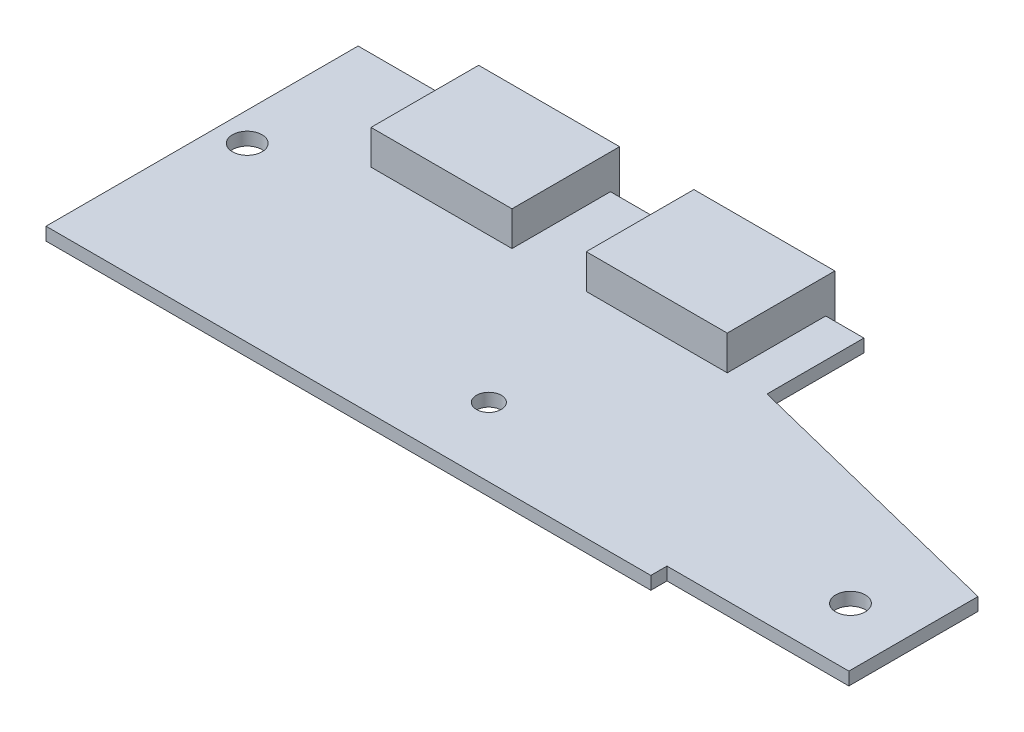
ISO-10303-21;
HEADER;
FILE_DESCRIPTION(('STEP AP214'),'2;1');
FILE_NAME('part.step','',(''),(''),'','','');
FILE_SCHEMA(('AUTOMOTIVE_DESIGN { 1 0 10303 214 1 1 1 1 }'));
ENDSEC;
DATA;
#1=APPLICATION_CONTEXT('core data for automotive mechanical design processes');
#2=APPLICATION_PROTOCOL_DEFINITION('international standard','automotive_design',2000,#1);
#3=PRODUCT_CONTEXT('',#1,'mechanical');
#4=PRODUCT('Part','Part','',(#3));
#5=PRODUCT_RELATED_PRODUCT_CATEGORY('part','',(#4));
#6=PRODUCT_DEFINITION_FORMATION('','',#4);
#7=PRODUCT_DEFINITION_CONTEXT('part definition',#1,'design');
#8=PRODUCT_DEFINITION('design','',#6,#7);
#9=PRODUCT_DEFINITION_SHAPE('','',#8);
#10=(LENGTH_UNIT() NAMED_UNIT(*) SI_UNIT(.MILLI.,.METRE.));
#11=(NAMED_UNIT(*) PLANE_ANGLE_UNIT() SI_UNIT($,.RADIAN.));
#12=(NAMED_UNIT(*) SI_UNIT($,.STERADIAN.) SOLID_ANGLE_UNIT());
#13=UNCERTAINTY_MEASURE_WITH_UNIT(LENGTH_MEASURE(1.E-05),#10,'distance_accuracy_value','');
#14=(GEOMETRIC_REPRESENTATION_CONTEXT(3) GLOBAL_UNCERTAINTY_ASSIGNED_CONTEXT((#13)) GLOBAL_UNIT_ASSIGNED_CONTEXT((#10,
#11,#12)) REPRESENTATION_CONTEXT('',''));
#15=CARTESIAN_POINT('',(0.,0.,0.));
#16=DIRECTION('',(0.,0.,1.));
#17=DIRECTION('',(1.,0.,0.));
#18=AXIS2_PLACEMENT_3D('',#15,#16,#17);
#19=CARTESIAN_POINT('',(0.,0.,0.));
#20=DIRECTION('',(0.,-1.,0.));
#21=DIRECTION('',(0.,0.,-1.));
#22=AXIS2_PLACEMENT_3D('',#19,#20,#21);
#23=PLANE('',#22);
#24=DIRECTION('',(0.,0.,-1.));
#25=VECTOR('',#24,1.);
#26=CARTESIAN_POINT('',(30.35,0.,0.));
#27=LINE('',#26,#25);
#28=CARTESIAN_POINT('',(30.35,0.,-19.85));
#29=VERTEX_POINT('',#28);
#30=CARTESIAN_POINT('',(30.35,0.,-29.));
#31=VERTEX_POINT('',#30);
#32=EDGE_CURVE('E11',#29,#31,#27,.T.);
#33=ORIENTED_EDGE('',*,*,#32,.F.);
#34=DIRECTION('',(-1.,0.,0.));
#35=VECTOR('',#34,1.);
#36=CARTESIAN_POINT('',(0.,0.,-19.85));
#37=LINE('',#36,#35);
#38=CARTESIAN_POINT('',(43.45,0.,-19.85));
#39=VERTEX_POINT('',#38);
#40=EDGE_CURVE('E432',#39,#29,#37,.T.);
#41=ORIENTED_EDGE('',*,*,#40,.F.);
#42=DIRECTION('',(0.,0.,1.));
#43=VECTOR('',#42,1.);
#44=CARTESIAN_POINT('',(43.45,0.,0.));
#45=LINE('',#44,#43);
#46=CARTESIAN_POINT('',(43.45,0.,-29.));
#47=VERTEX_POINT('',#46);
#48=EDGE_CURVE('E43',#47,#39,#45,.T.);
#49=ORIENTED_EDGE('',*,*,#48,.F.);
#50=DIRECTION('',(-1.,0.,0.));
#51=VECTOR('',#50,1.);
#52=CARTESIAN_POINT('',(0.,0.,-29.));
#53=LINE('',#52,#51);
#54=CARTESIAN_POINT('',(47.,0.,-29.));
#55=VERTEX_POINT('',#54);
#56=EDGE_CURVE('E395',#55,#47,#53,.T.);
#57=ORIENTED_EDGE('',*,*,#56,.F.);
#58=DIRECTION('',(0.,0.,-1.));
#59=VECTOR('',#58,1.);
#60=CARTESIAN_POINT('',(47.,0.,-29.));
#61=LINE('',#60,#59);
#62=CARTESIAN_POINT('',(47.,0.,-20.));
#63=VERTEX_POINT('',#62);
#64=EDGE_CURVE('E392',#63,#55,#61,.T.);
#65=ORIENTED_EDGE('',*,*,#64,.F.);
#66=DIRECTION('',(-0.970360803239584,0.,-0.241660736438977));
#67=VECTOR('',#66,1.);
#68=CARTESIAN_POINT('',(47.,0.,-20.));
#69=LINE('',#68,#67);
#70=CARTESIAN_POINT('',(73.1,0.,-13.5));
#71=VERTEX_POINT('',#70);
#72=EDGE_CURVE('E390',#71,#63,#69,.T.);
#73=ORIENTED_EDGE('',*,*,#72,.F.);
#74=DIRECTION('',(0.,0.,-1.));
#75=VECTOR('',#74,1.);
#76=CARTESIAN_POINT('',(73.1,0.,-13.5));
#77=LINE('',#76,#75);
#78=CARTESIAN_POINT('',(73.1,0.,-1.50000000000001));
#79=VERTEX_POINT('',#78);
#80=EDGE_CURVE('E388',#79,#71,#77,.T.);
#81=ORIENTED_EDGE('',*,*,#80,.F.);
#82=DIRECTION('',(1.,0.,0.));
#83=VECTOR('',#82,1.);
#84=CARTESIAN_POINT('',(73.1,0.,-1.50000000000001));
#85=LINE('',#84,#83);
#86=CARTESIAN_POINT('',(56.2,0.,-1.50000000000001));
#87=VERTEX_POINT('',#86);
#88=EDGE_CURVE('E386',#87,#79,#85,.T.);
#89=ORIENTED_EDGE('',*,*,#88,.F.);
#90=DIRECTION('',(0.,0.,-1.));
#91=VECTOR('',#90,1.);
#92=CARTESIAN_POINT('',(56.2,0.,-1.50000000000001));
#93=LINE('',#92,#91);
#94=CARTESIAN_POINT('',(56.2,0.,0.));
#95=VERTEX_POINT('',#94);
#96=EDGE_CURVE('E384',#95,#87,#93,.T.);
#97=ORIENTED_EDGE('',*,*,#96,.F.);
#98=DIRECTION('',(1.,0.,0.));
#99=VECTOR('',#98,1.);
#100=CARTESIAN_POINT('',(56.2,0.,0.));
#101=LINE('',#100,#99);
#102=CARTESIAN_POINT('',(0.,0.,0.));
#103=VERTEX_POINT('',#102);
#104=EDGE_CURVE('E345',#103,#95,#101,.T.);
#105=ORIENTED_EDGE('',*,*,#104,.F.);
#106=DIRECTION('',(0.,0.,1.));
#107=VECTOR('',#106,1.);
#108=CARTESIAN_POINT('',(0.,0.,0.));
#109=LINE('',#108,#107);
#110=CARTESIAN_POINT('',(0.,0.,-29.));
#111=VERTEX_POINT('',#110);
#112=EDGE_CURVE('E364',#111,#103,#109,.T.);
#113=ORIENTED_EDGE('',*,*,#112,.F.);
#114=CARTESIAN_POINT('',(10.35,0.,-29.));
#115=VERTEX_POINT('',#114);
#116=EDGE_CURVE('E394',#115,#111,#53,.T.);
#117=ORIENTED_EDGE('',*,*,#116,.F.);
#118=DIRECTION('',(0.,0.,-1.));
#119=VECTOR('',#118,1.);
#120=CARTESIAN_POINT('',(10.35,0.,0.));
#121=LINE('',#120,#119);
#122=CARTESIAN_POINT('',(10.35,0.,-19.85));
#123=VERTEX_POINT('',#122);
#124=EDGE_CURVE('E429',#123,#115,#121,.T.);
#125=ORIENTED_EDGE('',*,*,#124,.F.);
#126=DIRECTION('',(-1.,0.,0.));
#127=VECTOR('',#126,1.);
#128=CARTESIAN_POINT('',(0.,0.,-19.85));
#129=LINE('',#128,#127);
#130=CARTESIAN_POINT('',(23.45,0.,-19.85));
#131=VERTEX_POINT('',#130);
#132=EDGE_CURVE('E423',#131,#123,#129,.T.);
#133=ORIENTED_EDGE('',*,*,#132,.F.);
#134=DIRECTION('',(0.,0.,1.));
#135=VECTOR('',#134,1.);
#136=CARTESIAN_POINT('',(23.45,0.,0.));
#137=LINE('',#136,#135);
#138=CARTESIAN_POINT('',(23.45,0.,-29.));
#139=VERTEX_POINT('',#138);
#140=EDGE_CURVE('E426',#139,#131,#137,.T.);
#141=ORIENTED_EDGE('',*,*,#140,.F.);
#142=EDGE_CURVE('E398',#31,#139,#53,.T.);
#143=ORIENTED_EDGE('',*,*,#142,.F.);
#144=EDGE_LOOP('',(#33,#41,#49,#57,#65,#73,#81,#89,#97,#105,#113,#117,#125,#133,#141,#143));
#145=FACE_BOUND('',#144,.T.);
#146=CARTESIAN_POINT('',(2.675,0.,-16.025));
#147=DIRECTION('',(0.,1.,0.));
#148=DIRECTION('',(0.,0.,1.));
#149=AXIS2_PLACEMENT_3D('',#146,#147,#148);
#150=CIRCLE('',#149,1.375);
#151=CARTESIAN_POINT('',(2.675,0.,-14.65));
#152=VERTEX_POINT('',#151);
#153=EDGE_CURVE('E342',#152,#152,#150,.T.);
#154=ORIENTED_EDGE('',*,*,#153,.T.);
#155=EDGE_LOOP('',(#154));
#156=FACE_BOUND('',#155,.T.);
#157=CARTESIAN_POINT('',(67.725,0.,-7.02500000000001));
#158=DIRECTION('',(0.,1.,0.));
#159=DIRECTION('',(0.,0.,1.));
#160=AXIS2_PLACEMENT_3D('',#157,#158,#159);
#161=CIRCLE('',#160,1.375);
#162=CARTESIAN_POINT('',(67.725,0.,-5.65));
#163=VERTEX_POINT('',#162);
#164=EDGE_CURVE('E349',#163,#163,#161,.T.);
#165=ORIENTED_EDGE('',*,*,#164,.T.);
#166=EDGE_LOOP('',(#165));
#167=FACE_BOUND('',#166,.T.);
#168=CARTESIAN_POINT('',(34.75,0.,-6.4));
#169=DIRECTION('',(0.,1.,0.));
#170=DIRECTION('',(0.,0.,1.));
#171=AXIS2_PLACEMENT_3D('',#168,#169,#170);
#172=CIRCLE('',#171,1.15);
#173=CARTESIAN_POINT('',(34.75,0.,-5.25));
#174=VERTEX_POINT('',#173);
#175=EDGE_CURVE('E355',#174,#174,#172,.T.);
#176=ORIENTED_EDGE('',*,*,#175,.T.);
#177=EDGE_LOOP('',(#176));
#178=FACE_BOUND('',#177,.T.);
#179=DIRECTION('',(1.,0.,0.));
#180=VECTOR('',#179,1.);
#181=CARTESIAN_POINT('',(15.5,0.,-10.8));
#182=LINE('',#181,#180);
#183=CARTESIAN_POINT('',(15.5,0.,-10.8));
#184=VERTEX_POINT('',#183);
#185=CARTESIAN_POINT('',(20.8,0.,-10.8));
#186=VERTEX_POINT('',#185);
#187=EDGE_CURVE('E821',#184,#186,#182,.T.);
#188=ORIENTED_EDGE('',*,*,#187,.F.);
#189=DIRECTION('',(0.,0.,-1.));
#190=VECTOR('',#189,1.);
#191=CARTESIAN_POINT('',(15.5,0.,-5.5));
#192=LINE('',#191,#190);
#193=CARTESIAN_POINT('',(15.5,0.,-5.5));
#194=VERTEX_POINT('',#193);
#195=EDGE_CURVE('E243',#194,#184,#192,.T.);
#196=ORIENTED_EDGE('',*,*,#195,.F.);
#197=DIRECTION('',(-1.,0.,0.));
#198=VECTOR('',#197,1.);
#199=CARTESIAN_POINT('',(15.5,0.,-5.5));
#200=LINE('',#199,#198);
#201=CARTESIAN_POINT('',(20.8,0.,-5.5));
#202=VERTEX_POINT('',#201);
#203=EDGE_CURVE('E239',#202,#194,#200,.T.);
#204=ORIENTED_EDGE('',*,*,#203,.F.);
#205=DIRECTION('',(0.,0.,1.));
#206=VECTOR('',#205,1.);
#207=CARTESIAN_POINT('',(20.8,0.,-5.5));
#208=LINE('',#207,#206);
#209=EDGE_CURVE('E818',#186,#202,#208,.T.);
#210=ORIENTED_EDGE('',*,*,#209,.F.);
#211=EDGE_LOOP('',(#188,#196,#204,#210));
#212=FACE_BOUND('',#211,.T.);
#213=ADVANCED_FACE('F35',(#145,#156,#167,#178,#212),#23,.T.);
#214=CARTESIAN_POINT('',(0.,1.2,-29.));
#215=DIRECTION('',(0.,0.,1.));
#216=DIRECTION('',(1.,0.,0.));
#217=AXIS2_PLACEMENT_3D('',#214,#215,#216);
#218=PLANE('',#217);
#219=DIRECTION('',(-1.,0.,0.));
#220=VECTOR('',#219,1.);
#221=CARTESIAN_POINT('',(0.,1.2,-29.));
#222=LINE('',#221,#220);
#223=CARTESIAN_POINT('',(30.35,1.2,-29.));
#224=VERTEX_POINT('',#223);
#225=CARTESIAN_POINT('',(23.45,1.2,-29.));
#226=VERTEX_POINT('',#225);
#227=EDGE_CURVE('E379',#224,#226,#222,.T.);
#228=ORIENTED_EDGE('',*,*,#227,.F.);
#229=DIRECTION('',(0.,-1.,0.));
#230=VECTOR('',#229,1.);
#231=CARTESIAN_POINT('',(30.35,1.2,-29.));
#232=LINE('',#231,#230);
#233=EDGE_CURVE('E290',#224,#31,#232,.T.);
#234=ORIENTED_EDGE('',*,*,#233,.T.);
#235=ORIENTED_EDGE('',*,*,#142,.T.);
#236=DIRECTION('',(0.,1.,0.));
#237=VECTOR('',#236,1.);
#238=CARTESIAN_POINT('',(23.45,1.2,-29.));
#239=LINE('',#238,#237);
#240=EDGE_CURVE('E332',#139,#226,#239,.T.);
#241=ORIENTED_EDGE('',*,*,#240,.T.);
#242=EDGE_LOOP('',(#228,#234,#235,#241));
#243=FACE_BOUND('',#242,.T.);
#244=ADVANCED_FACE('F467',(#243),#218,.F.);
#245=CARTESIAN_POINT('',(10.35,1.2,-29.));
#246=VERTEX_POINT('',#245);
#247=CARTESIAN_POINT('',(0.,1.2,-29.));
#248=VERTEX_POINT('',#247);
#249=EDGE_CURVE('E374',#246,#248,#222,.T.);
#250=ORIENTED_EDGE('',*,*,#249,.F.);
#251=DIRECTION('',(0.,-1.,0.));
#252=VECTOR('',#251,1.);
#253=CARTESIAN_POINT('',(10.35,1.2,-29.));
#254=LINE('',#253,#252);
#255=EDGE_CURVE('E337',#246,#115,#254,.T.);
#256=ORIENTED_EDGE('',*,*,#255,.T.);
#257=ORIENTED_EDGE('',*,*,#116,.T.);
#258=DIRECTION('',(0.,-1.,0.));
#259=VECTOR('',#258,1.);
#260=CARTESIAN_POINT('',(0.,1.2,-29.));
#261=LINE('',#260,#259);
#262=EDGE_CURVE('E402',#248,#111,#261,.T.);
#263=ORIENTED_EDGE('',*,*,#262,.F.);
#264=EDGE_LOOP('',(#250,#256,#257,#263));
#265=FACE_BOUND('',#264,.T.);
#266=ADVANCED_FACE('F478',(#265),#218,.F.);
#267=CARTESIAN_POINT('',(56.2,1.2,0.));
#268=DIRECTION('',(0.,0.,-1.));
#269=DIRECTION('',(-1.,0.,0.));
#270=AXIS2_PLACEMENT_3D('',#267,#268,#269);
#271=PLANE('',#270);
#272=ORIENTED_EDGE('',*,*,#104,.T.);
#273=DIRECTION('',(0.,-1.,0.));
#274=VECTOR('',#273,1.);
#275=CARTESIAN_POINT('',(56.2,1.2,0.));
#276=LINE('',#275,#274);
#277=CARTESIAN_POINT('',(56.2,1.2,0.));
#278=VERTEX_POINT('',#277);
#279=EDGE_CURVE('E420',#278,#95,#276,.T.);
#280=ORIENTED_EDGE('',*,*,#279,.F.);
#281=DIRECTION('',(1.,0.,0.));
#282=VECTOR('',#281,1.);
#283=CARTESIAN_POINT('',(56.2,1.2,0.));
#284=LINE('',#283,#282);
#285=CARTESIAN_POINT('',(0.,1.2,0.));
#286=VERTEX_POINT('',#285);
#287=EDGE_CURVE('E360',#286,#278,#284,.T.);
#288=ORIENTED_EDGE('',*,*,#287,.F.);
#289=DIRECTION('',(0.,-1.,0.));
#290=VECTOR('',#289,1.);
#291=CARTESIAN_POINT('',(0.,1.2,0.));
#292=LINE('',#291,#290);
#293=EDGE_CURVE('E381',#286,#103,#292,.T.);
#294=ORIENTED_EDGE('',*,*,#293,.T.);
#295=EDGE_LOOP('',(#272,#280,#288,#294));
#296=FACE_BOUND('',#295,.T.);
#297=ADVANCED_FACE('F37',(#296),#271,.F.);
#298=CARTESIAN_POINT('',(56.2,1.2,-1.50000000000001));
#299=DIRECTION('',(-1.,0.,0.));
#300=DIRECTION('',(0.,0.,1.));
#301=AXIS2_PLACEMENT_3D('',#298,#299,#300);
#302=PLANE('',#301);
#303=ORIENTED_EDGE('',*,*,#96,.T.);
#304=DIRECTION('',(0.,-1.,0.));
#305=VECTOR('',#304,1.);
#306=CARTESIAN_POINT('',(56.2,1.2,-1.50000000000001));
#307=LINE('',#306,#305);
#308=CARTESIAN_POINT('',(56.2,1.2,-1.50000000000001));
#309=VERTEX_POINT('',#308);
#310=EDGE_CURVE('E417',#309,#87,#307,.T.);
#311=ORIENTED_EDGE('',*,*,#310,.F.);
#312=DIRECTION('',(0.,0.,-1.));
#313=VECTOR('',#312,1.);
#314=CARTESIAN_POINT('',(56.2,1.2,-1.50000000000001));
#315=LINE('',#314,#313);
#316=EDGE_CURVE('E363',#278,#309,#315,.T.);
#317=ORIENTED_EDGE('',*,*,#316,.F.);
#318=ORIENTED_EDGE('',*,*,#279,.T.);
#319=EDGE_LOOP('',(#303,#311,#317,#318));
#320=FACE_BOUND('',#319,.T.);
#321=ADVANCED_FACE('F491',(#320),#302,.F.);
#322=CARTESIAN_POINT('',(73.1,1.2,-1.50000000000001));
#323=DIRECTION('',(0.,0.,-1.));
#324=DIRECTION('',(-1.,0.,0.));
#325=AXIS2_PLACEMENT_3D('',#322,#323,#324);
#326=PLANE('',#325);
#327=ORIENTED_EDGE('',*,*,#88,.T.);
#328=DIRECTION('',(0.,-1.,0.));
#329=VECTOR('',#328,1.);
#330=CARTESIAN_POINT('',(73.1,1.2,-1.50000000000001));
#331=LINE('',#330,#329);
#332=CARTESIAN_POINT('',(73.1,1.2,-1.50000000000001));
#333=VERTEX_POINT('',#332);
#334=EDGE_CURVE('E414',#333,#79,#331,.T.);
#335=ORIENTED_EDGE('',*,*,#334,.F.);
#336=DIRECTION('',(1.,0.,0.));
#337=VECTOR('',#336,1.);
#338=CARTESIAN_POINT('',(73.1,1.2,-1.50000000000001));
#339=LINE('',#338,#337);
#340=EDGE_CURVE('E366',#309,#333,#339,.T.);
#341=ORIENTED_EDGE('',*,*,#340,.F.);
#342=ORIENTED_EDGE('',*,*,#310,.T.);
#343=EDGE_LOOP('',(#327,#335,#341,#342));
#344=FACE_BOUND('',#343,.T.);
#345=ADVANCED_FACE('F494',(#344),#326,.F.);
#346=CARTESIAN_POINT('',(73.1,1.2,-13.5));
#347=DIRECTION('',(-1.,0.,0.));
#348=DIRECTION('',(0.,0.,1.));
#349=AXIS2_PLACEMENT_3D('',#346,#347,#348);
#350=PLANE('',#349);
#351=ORIENTED_EDGE('',*,*,#80,.T.);
#352=DIRECTION('',(0.,-1.,0.));
#353=VECTOR('',#352,1.);
#354=CARTESIAN_POINT('',(73.1,1.2,-13.5));
#355=LINE('',#354,#353);
#356=CARTESIAN_POINT('',(73.1,1.2,-13.5));
#357=VERTEX_POINT('',#356);
#358=EDGE_CURVE('E411',#357,#71,#355,.T.);
#359=ORIENTED_EDGE('',*,*,#358,.F.);
#360=DIRECTION('',(0.,0.,-1.));
#361=VECTOR('',#360,1.);
#362=CARTESIAN_POINT('',(73.1,1.2,-13.5));
#363=LINE('',#362,#361);
#364=EDGE_CURVE('E368',#333,#357,#363,.T.);
#365=ORIENTED_EDGE('',*,*,#364,.F.);
#366=ORIENTED_EDGE('',*,*,#334,.T.);
#367=EDGE_LOOP('',(#351,#359,#365,#366));
#368=FACE_BOUND('',#367,.T.);
#369=ADVANCED_FACE('F499',(#368),#350,.F.);
#370=CARTESIAN_POINT('',(47.,1.2,-20.));
#371=DIRECTION('',(-0.241660736438977,0.,0.970360803239585));
#372=DIRECTION('',(0.970360803239585,0.,0.241660736438977));
#373=AXIS2_PLACEMENT_3D('',#370,#371,#372);
#374=PLANE('',#373);
#375=ORIENTED_EDGE('',*,*,#72,.T.);
#376=DIRECTION('',(0.,-1.,0.));
#377=VECTOR('',#376,1.);
#378=CARTESIAN_POINT('',(47.,1.2,-20.));
#379=LINE('',#378,#377);
#380=CARTESIAN_POINT('',(47.,1.2,-20.));
#381=VERTEX_POINT('',#380);
#382=EDGE_CURVE('E408',#381,#63,#379,.T.);
#383=ORIENTED_EDGE('',*,*,#382,.F.);
#384=DIRECTION('',(-0.970360803239584,0.,-0.241660736438977));
#385=VECTOR('',#384,1.);
#386=CARTESIAN_POINT('',(47.,1.2,-20.));
#387=LINE('',#386,#385);
#388=EDGE_CURVE('E370',#357,#381,#387,.T.);
#389=ORIENTED_EDGE('',*,*,#388,.F.);
#390=ORIENTED_EDGE('',*,*,#358,.T.);
#391=EDGE_LOOP('',(#375,#383,#389,#390));
#392=FACE_BOUND('',#391,.T.);
#393=ADVANCED_FACE('F505',(#392),#374,.F.);
#394=CARTESIAN_POINT('',(47.,1.2,-29.));
#395=DIRECTION('',(-1.,0.,0.));
#396=DIRECTION('',(0.,0.,1.));
#397=AXIS2_PLACEMENT_3D('',#394,#395,#396);
#398=PLANE('',#397);
#399=ORIENTED_EDGE('',*,*,#64,.T.);
#400=DIRECTION('',(0.,-1.,0.));
#401=VECTOR('',#400,1.);
#402=CARTESIAN_POINT('',(47.,1.2,-29.));
#403=LINE('',#402,#401);
#404=CARTESIAN_POINT('',(47.,1.2,-29.));
#405=VERTEX_POINT('',#404);
#406=EDGE_CURVE('E405',#405,#55,#403,.T.);
#407=ORIENTED_EDGE('',*,*,#406,.F.);
#408=DIRECTION('',(0.,0.,-1.));
#409=VECTOR('',#408,1.);
#410=CARTESIAN_POINT('',(47.,1.2,-29.));
#411=LINE('',#410,#409);
#412=EDGE_CURVE('E372',#381,#405,#411,.T.);
#413=ORIENTED_EDGE('',*,*,#412,.F.);
#414=ORIENTED_EDGE('',*,*,#382,.T.);
#415=EDGE_LOOP('',(#399,#407,#413,#414));
#416=FACE_BOUND('',#415,.T.);
#417=ADVANCED_FACE('F509',(#416),#398,.F.);
#418=ORIENTED_EDGE('',*,*,#56,.T.);
#419=DIRECTION('',(0.,1.,0.));
#420=VECTOR('',#419,1.);
#421=CARTESIAN_POINT('',(43.45,1.2,-29.));
#422=LINE('',#421,#420);
#423=CARTESIAN_POINT('',(43.45,1.2,-29.));
#424=VERTEX_POINT('',#423);
#425=EDGE_CURVE('E286',#47,#424,#422,.T.);
#426=ORIENTED_EDGE('',*,*,#425,.T.);
#427=EDGE_CURVE('E375',#405,#424,#222,.T.);
#428=ORIENTED_EDGE('',*,*,#427,.F.);
#429=ORIENTED_EDGE('',*,*,#406,.T.);
#430=EDGE_LOOP('',(#418,#426,#428,#429));
#431=FACE_BOUND('',#430,.T.);
#432=ADVANCED_FACE('F512',(#431),#218,.F.);
#433=CARTESIAN_POINT('',(0.,1.2,0.));
#434=DIRECTION('',(1.,0.,0.));
#435=DIRECTION('',(0.,0.,-1.));
#436=AXIS2_PLACEMENT_3D('',#433,#434,#435);
#437=PLANE('',#436);
#438=ORIENTED_EDGE('',*,*,#112,.T.);
#439=ORIENTED_EDGE('',*,*,#293,.F.);
#440=DIRECTION('',(0.,0.,1.));
#441=VECTOR('',#440,1.);
#442=CARTESIAN_POINT('',(0.,1.2,0.));
#443=LINE('',#442,#441);
#444=EDGE_CURVE('E378',#248,#286,#443,.T.);
#445=ORIENTED_EDGE('',*,*,#444,.F.);
#446=ORIENTED_EDGE('',*,*,#262,.T.);
#447=EDGE_LOOP('',(#438,#439,#445,#446));
#448=FACE_BOUND('',#447,.T.);
#449=ADVANCED_FACE('F482',(#448),#437,.F.);
#450=CARTESIAN_POINT('',(0.,1.2,0.));
#451=DIRECTION('',(0.,-1.,0.));
#452=DIRECTION('',(0.,0.,-1.));
#453=AXIS2_PLACEMENT_3D('',#450,#451,#452);
#454=PLANE('',#453);
#455=CARTESIAN_POINT('',(2.675,1.2,-16.025));
#456=DIRECTION('',(0.,1.,0.));
#457=DIRECTION('',(0.,0.,1.));
#458=AXIS2_PLACEMENT_3D('',#455,#456,#457);
#459=CIRCLE('',#458,1.375);
#460=CARTESIAN_POINT('',(2.675,1.2,-14.65));
#461=VERTEX_POINT('',#460);
#462=EDGE_CURVE('E346',#461,#461,#459,.T.);
#463=ORIENTED_EDGE('',*,*,#462,.F.);
#464=EDGE_LOOP('',(#463));
#465=FACE_BOUND('',#464,.T.);
#466=CARTESIAN_POINT('',(67.725,1.2,-7.02500000000001));
#467=DIRECTION('',(0.,1.,0.));
#468=DIRECTION('',(0.,0.,1.));
#469=AXIS2_PLACEMENT_3D('',#466,#467,#468);
#470=CIRCLE('',#469,1.375);
#471=CARTESIAN_POINT('',(67.725,1.2,-5.65));
#472=VERTEX_POINT('',#471);
#473=EDGE_CURVE('E352',#472,#472,#470,.T.);
#474=ORIENTED_EDGE('',*,*,#473,.F.);
#475=EDGE_LOOP('',(#474));
#476=FACE_BOUND('',#475,.T.);
#477=CARTESIAN_POINT('',(34.75,1.2,-6.4));
#478=DIRECTION('',(0.,1.,0.));
#479=DIRECTION('',(0.,0.,1.));
#480=AXIS2_PLACEMENT_3D('',#477,#478,#479);
#481=CIRCLE('',#480,1.15);
#482=CARTESIAN_POINT('',(34.75,1.2,-5.25));
#483=VERTEX_POINT('',#482);
#484=EDGE_CURVE('E341',#483,#483,#481,.T.);
#485=ORIENTED_EDGE('',*,*,#484,.F.);
#486=EDGE_LOOP('',(#485));
#487=FACE_BOUND('',#486,.T.);
#488=DIRECTION('',(-1.,0.,0.));
#489=VECTOR('',#488,1.);
#490=CARTESIAN_POINT('',(0.,1.2,-19.85));
#491=LINE('',#490,#489);
#492=CARTESIAN_POINT('',(43.45,1.2,-19.85));
#493=VERTEX_POINT('',#492);
#494=CARTESIAN_POINT('',(30.35,1.2,-19.85));
#495=VERTEX_POINT('',#494);
#496=EDGE_CURVE('E58',#493,#495,#491,.T.);
#497=ORIENTED_EDGE('',*,*,#496,.T.);
#498=DIRECTION('',(0.,0.,-1.));
#499=VECTOR('',#498,1.);
#500=CARTESIAN_POINT('',(30.35,1.2,0.));
#501=LINE('',#500,#499);
#502=EDGE_CURVE('E292',#495,#224,#501,.T.);
#503=ORIENTED_EDGE('',*,*,#502,.T.);
#504=ORIENTED_EDGE('',*,*,#227,.T.);
#505=DIRECTION('',(0.,0.,1.));
#506=VECTOR('',#505,1.);
#507=CARTESIAN_POINT('',(23.45,1.2,0.));
#508=LINE('',#507,#506);
#509=CARTESIAN_POINT('',(23.45,1.2,-19.85));
#510=VERTEX_POINT('',#509);
#511=EDGE_CURVE('E335',#226,#510,#508,.T.);
#512=ORIENTED_EDGE('',*,*,#511,.T.);
#513=DIRECTION('',(-1.,0.,0.));
#514=VECTOR('',#513,1.);
#515=CARTESIAN_POINT('',(0.,1.2,-19.85));
#516=LINE('',#515,#514);
#517=CARTESIAN_POINT('',(10.35,1.2,-19.85));
#518=VERTEX_POINT('',#517);
#519=EDGE_CURVE('E321',#510,#518,#516,.T.);
#520=ORIENTED_EDGE('',*,*,#519,.T.);
#521=DIRECTION('',(0.,0.,-1.));
#522=VECTOR('',#521,1.);
#523=CARTESIAN_POINT('',(10.35,1.2,0.));
#524=LINE('',#523,#522);
#525=EDGE_CURVE('E339',#518,#246,#524,.T.);
#526=ORIENTED_EDGE('',*,*,#525,.T.);
#527=ORIENTED_EDGE('',*,*,#249,.T.);
#528=ORIENTED_EDGE('',*,*,#444,.T.);
#529=ORIENTED_EDGE('',*,*,#287,.T.);
#530=ORIENTED_EDGE('',*,*,#316,.T.);
#531=ORIENTED_EDGE('',*,*,#340,.T.);
#532=ORIENTED_EDGE('',*,*,#364,.T.);
#533=ORIENTED_EDGE('',*,*,#388,.T.);
#534=ORIENTED_EDGE('',*,*,#412,.T.);
#535=ORIENTED_EDGE('',*,*,#427,.T.);
#536=DIRECTION('',(0.,0.,1.));
#537=VECTOR('',#536,1.);
#538=CARTESIAN_POINT('',(43.45,1.2,0.));
#539=LINE('',#538,#537);
#540=EDGE_CURVE('E288',#424,#493,#539,.T.);
#541=ORIENTED_EDGE('',*,*,#540,.T.);
#542=EDGE_LOOP('',(#497,#503,#504,#512,#520,#526,#527,#528,#529,#530,#531,#532,#533,#534,#535,#541));
#543=FACE_BOUND('',#542,.T.);
#544=ADVANCED_FACE('F465',(#465,#476,#487,#543),#454,.F.);
#545=CARTESIAN_POINT('',(34.75,0.,-6.4));
#546=DIRECTION('',(0.,1.,0.));
#547=DIRECTION('',(0.,0.,1.));
#548=AXIS2_PLACEMENT_3D('',#545,#546,#547);
#549=CYLINDRICAL_SURFACE('',#548,1.15);
#550=ORIENTED_EDGE('',*,*,#175,.F.);
#551=EDGE_LOOP('',(#550));
#552=FACE_BOUND('',#551,.T.);
#553=ORIENTED_EDGE('',*,*,#484,.T.);
#554=EDGE_LOOP('',(#553));
#555=FACE_BOUND('',#554,.T.);
#556=ADVANCED_FACE('F604',(#552,#555),#549,.F.);
#557=CARTESIAN_POINT('',(67.725,0.,-7.02500000000001));
#558=DIRECTION('',(0.,1.,0.));
#559=DIRECTION('',(0.,0.,1.));
#560=AXIS2_PLACEMENT_3D('',#557,#558,#559);
#561=CYLINDRICAL_SURFACE('',#560,1.375);
#562=ORIENTED_EDGE('',*,*,#164,.F.);
#563=EDGE_LOOP('',(#562));
#564=FACE_BOUND('',#563,.T.);
#565=ORIENTED_EDGE('',*,*,#473,.T.);
#566=EDGE_LOOP('',(#565));
#567=FACE_BOUND('',#566,.T.);
#568=ADVANCED_FACE('F593',(#564,#567),#561,.F.);
#569=CARTESIAN_POINT('',(2.675,0.,-16.025));
#570=DIRECTION('',(0.,1.,0.));
#571=DIRECTION('',(0.,0.,1.));
#572=AXIS2_PLACEMENT_3D('',#569,#570,#571);
#573=CYLINDRICAL_SURFACE('',#572,1.375);
#574=ORIENTED_EDGE('',*,*,#153,.F.);
#575=EDGE_LOOP('',(#574));
#576=FACE_BOUND('',#575,.T.);
#577=ORIENTED_EDGE('',*,*,#462,.T.);
#578=EDGE_LOOP('',(#577));
#579=FACE_BOUND('',#578,.T.);
#580=ADVANCED_FACE('F588',(#576,#579),#573,.F.);
#581=CARTESIAN_POINT('',(10.35,-1.3,-29.85));
#582=DIRECTION('',(-1.,0.,0.));
#583=DIRECTION('',(0.,0.,1.));
#584=AXIS2_PLACEMENT_3D('',#581,#582,#583);
#585=PLANE('',#584);
#586=ORIENTED_EDGE('',*,*,#525,.F.);
#587=DIRECTION('',(0.,1.,0.));
#588=VECTOR('',#587,1.);
#589=CARTESIAN_POINT('',(10.35,-1.3,-19.85));
#590=LINE('',#589,#588);
#591=CARTESIAN_POINT('',(10.35,4.4,-19.85));
#592=VERTEX_POINT('',#591);
#593=EDGE_CURVE('E318',#518,#592,#590,.T.);
#594=ORIENTED_EDGE('',*,*,#593,.T.);
#595=DIRECTION('',(0.,0.,1.));
#596=VECTOR('',#595,1.);
#597=CARTESIAN_POINT('',(10.35,4.4,-29.85));
#598=LINE('',#597,#596);
#599=CARTESIAN_POINT('',(10.35,4.4,-29.85));
#600=VERTEX_POINT('',#599);
#601=EDGE_CURVE('E294',#600,#592,#598,.T.);
#602=ORIENTED_EDGE('',*,*,#601,.F.);
#603=DIRECTION('',(0.,1.,0.));
#604=VECTOR('',#603,1.);
#605=CARTESIAN_POINT('',(10.35,-1.3,-29.85));
#606=LINE('',#605,#604);
#607=CARTESIAN_POINT('',(10.35,-1.3,-29.85));
#608=VERTEX_POINT('',#607);
#609=EDGE_CURVE('E319',#608,#600,#606,.T.);
#610=ORIENTED_EDGE('',*,*,#609,.F.);
#611=DIRECTION('',(0.,0.,1.));
#612=VECTOR('',#611,1.);
#613=CARTESIAN_POINT('',(10.35,-1.3,-29.85));
#614=LINE('',#613,#612);
#615=CARTESIAN_POINT('',(10.35,-1.3,-19.85));
#616=VERTEX_POINT('',#615);
#617=EDGE_CURVE('E306',#608,#616,#614,.T.);
#618=ORIENTED_EDGE('',*,*,#617,.T.);
#619=EDGE_CURVE('E328',#616,#123,#590,.T.);
#620=ORIENTED_EDGE('',*,*,#619,.T.);
#621=ORIENTED_EDGE('',*,*,#124,.T.);
#622=ORIENTED_EDGE('',*,*,#255,.F.);
#623=EDGE_LOOP('',(#586,#594,#602,#610,#618,#620,#621,#622));
#624=FACE_BOUND('',#623,.T.);
#625=ADVANCED_FACE('F515',(#624),#585,.T.);
#626=CARTESIAN_POINT('',(23.45,-1.3,-29.85));
#627=DIRECTION('',(1.,0.,0.));
#628=DIRECTION('',(0.,0.,-1.));
#629=AXIS2_PLACEMENT_3D('',#626,#627,#628);
#630=PLANE('',#629);
#631=ORIENTED_EDGE('',*,*,#511,.F.);
#632=ORIENTED_EDGE('',*,*,#240,.F.);
#633=ORIENTED_EDGE('',*,*,#140,.T.);
#634=DIRECTION('',(0.,1.,0.));
#635=VECTOR('',#634,1.);
#636=CARTESIAN_POINT('',(23.45,-1.3,-19.85));
#637=LINE('',#636,#635);
#638=CARTESIAN_POINT('',(23.45,-1.3,-19.85));
#639=VERTEX_POINT('',#638);
#640=EDGE_CURVE('E324',#639,#131,#637,.T.);
#641=ORIENTED_EDGE('',*,*,#640,.F.);
#642=DIRECTION('',(0.,0.,-1.));
#643=VECTOR('',#642,1.);
#644=CARTESIAN_POINT('',(23.45,-1.3,-29.85));
#645=LINE('',#644,#643);
#646=CARTESIAN_POINT('',(23.45,-1.3,-29.85));
#647=VERTEX_POINT('',#646);
#648=EDGE_CURVE('E312',#639,#647,#645,.T.);
#649=ORIENTED_EDGE('',*,*,#648,.T.);
#650=DIRECTION('',(0.,1.,0.));
#651=VECTOR('',#650,1.);
#652=CARTESIAN_POINT('',(23.45,-1.3,-29.85));
#653=LINE('',#652,#651);
#654=CARTESIAN_POINT('',(23.45,4.4,-29.85));
#655=VERTEX_POINT('',#654);
#656=EDGE_CURVE('E322',#647,#655,#653,.T.);
#657=ORIENTED_EDGE('',*,*,#656,.T.);
#658=DIRECTION('',(0.,0.,-1.));
#659=VECTOR('',#658,1.);
#660=CARTESIAN_POINT('',(23.45,4.4,-29.85));
#661=LINE('',#660,#659);
#662=CARTESIAN_POINT('',(23.45,4.4,-19.85));
#663=VERTEX_POINT('',#662);
#664=EDGE_CURVE('E300',#663,#655,#661,.T.);
#665=ORIENTED_EDGE('',*,*,#664,.F.);
#666=EDGE_CURVE('E327',#510,#663,#637,.T.);
#667=ORIENTED_EDGE('',*,*,#666,.F.);
#668=EDGE_LOOP('',(#631,#632,#633,#641,#649,#657,#665,#667));
#669=FACE_BOUND('',#668,.T.);
#670=ADVANCED_FACE('F525',(#669),#630,.T.);
#671=CARTESIAN_POINT('',(10.35,-1.3,-19.85));
#672=DIRECTION('',(0.,0.,1.));
#673=DIRECTION('',(1.,0.,0.));
#674=AXIS2_PLACEMENT_3D('',#671,#672,#673);
#675=PLANE('',#674);
#676=ORIENTED_EDGE('',*,*,#519,.F.);
#677=ORIENTED_EDGE('',*,*,#666,.T.);
#678=DIRECTION('',(1.,0.,0.));
#679=VECTOR('',#678,1.);
#680=CARTESIAN_POINT('',(10.35,4.4,-19.85));
#681=LINE('',#680,#679);
#682=EDGE_CURVE('E297',#592,#663,#681,.T.);
#683=ORIENTED_EDGE('',*,*,#682,.F.);
#684=ORIENTED_EDGE('',*,*,#593,.F.);
#685=EDGE_LOOP('',(#676,#677,#683,#684));
#686=FACE_BOUND('',#685,.T.);
#687=ADVANCED_FACE('F532',(#686),#675,.T.);
#688=CARTESIAN_POINT('',(10.35,-1.3,-29.85));
#689=DIRECTION('',(0.,0.,-1.));
#690=DIRECTION('',(-1.,0.,0.));
#691=AXIS2_PLACEMENT_3D('',#688,#689,#690);
#692=PLANE('',#691);
#693=ORIENTED_EDGE('',*,*,#609,.T.);
#694=DIRECTION('',(-1.,0.,0.));
#695=VECTOR('',#694,1.);
#696=CARTESIAN_POINT('',(10.35,4.4,-29.85));
#697=LINE('',#696,#695);
#698=EDGE_CURVE('E303',#655,#600,#697,.T.);
#699=ORIENTED_EDGE('',*,*,#698,.F.);
#700=ORIENTED_EDGE('',*,*,#656,.F.);
#701=DIRECTION('',(-1.,0.,0.));
#702=VECTOR('',#701,1.);
#703=CARTESIAN_POINT('',(10.35,-1.3,-29.85));
#704=LINE('',#703,#702);
#705=EDGE_CURVE('E315',#647,#608,#704,.T.);
#706=ORIENTED_EDGE('',*,*,#705,.T.);
#707=EDGE_LOOP('',(#693,#699,#700,#706));
#708=FACE_BOUND('',#707,.T.);
#709=ADVANCED_FACE('F539',(#708),#692,.T.);
#710=ORIENTED_EDGE('',*,*,#640,.T.);
#711=ORIENTED_EDGE('',*,*,#132,.T.);
#712=ORIENTED_EDGE('',*,*,#619,.F.);
#713=DIRECTION('',(1.,0.,0.));
#714=VECTOR('',#713,1.);
#715=CARTESIAN_POINT('',(10.35,-1.3,-19.85));
#716=LINE('',#715,#714);
#717=EDGE_CURVE('E309',#616,#639,#716,.T.);
#718=ORIENTED_EDGE('',*,*,#717,.T.);
#719=EDGE_LOOP('',(#710,#711,#712,#718));
#720=FACE_BOUND('',#719,.T.);
#721=ADVANCED_FACE('F519',(#720),#675,.T.);
#722=CARTESIAN_POINT('',(0.,-1.3,0.));
#723=DIRECTION('',(0.,1.,0.));
#724=DIRECTION('',(0.,0.,1.));
#725=AXIS2_PLACEMENT_3D('',#722,#723,#724);
#726=PLANE('',#725);
#727=ORIENTED_EDGE('',*,*,#617,.F.);
#728=ORIENTED_EDGE('',*,*,#705,.F.);
#729=ORIENTED_EDGE('',*,*,#648,.F.);
#730=ORIENTED_EDGE('',*,*,#717,.F.);
#731=EDGE_LOOP('',(#727,#728,#729,#730));
#732=FACE_BOUND('',#731,.T.);
#733=ADVANCED_FACE('F522',(#732),#726,.F.);
#734=CARTESIAN_POINT('',(0.,4.4,0.));
#735=DIRECTION('',(0.,1.,0.));
#736=DIRECTION('',(0.,0.,1.));
#737=AXIS2_PLACEMENT_3D('',#734,#735,#736);
#738=PLANE('',#737);
#739=ORIENTED_EDGE('',*,*,#601,.T.);
#740=ORIENTED_EDGE('',*,*,#682,.T.);
#741=ORIENTED_EDGE('',*,*,#664,.T.);
#742=ORIENTED_EDGE('',*,*,#698,.T.);
#743=EDGE_LOOP('',(#739,#740,#741,#742));
#744=FACE_BOUND('',#743,.T.);
#745=ADVANCED_FACE('F536',(#744),#738,.T.);
#746=CARTESIAN_POINT('',(30.35,-1.3,-29.85));
#747=DIRECTION('',(-1.,0.,0.));
#748=DIRECTION('',(0.,0.,1.));
#749=AXIS2_PLACEMENT_3D('',#746,#747,#748);
#750=PLANE('',#749);
#751=ORIENTED_EDGE('',*,*,#502,.F.);
#752=DIRECTION('',(0.,1.,0.));
#753=VECTOR('',#752,1.);
#754=CARTESIAN_POINT('',(30.35,-1.3,-19.85));
#755=LINE('',#754,#753);
#756=CARTESIAN_POINT('',(30.35,4.4,-19.85));
#757=VERTEX_POINT('',#756);
#758=EDGE_CURVE('E273',#495,#757,#755,.T.);
#759=ORIENTED_EDGE('',*,*,#758,.T.);
#760=DIRECTION('',(0.,0.,1.));
#761=VECTOR('',#760,1.);
#762=CARTESIAN_POINT('',(30.35,4.4,-29.85));
#763=LINE('',#762,#761);
#764=CARTESIAN_POINT('',(30.35,4.4,-29.85));
#765=VERTEX_POINT('',#764);
#766=EDGE_CURVE('E245',#765,#757,#763,.T.);
#767=ORIENTED_EDGE('',*,*,#766,.F.);
#768=DIRECTION('',(0.,1.,0.));
#769=VECTOR('',#768,1.);
#770=CARTESIAN_POINT('',(30.35,-1.3,-29.85));
#771=LINE('',#770,#769);
#772=CARTESIAN_POINT('',(30.35,-1.3,-29.85));
#773=VERTEX_POINT('',#772);
#774=EDGE_CURVE('E274',#773,#765,#771,.T.);
#775=ORIENTED_EDGE('',*,*,#774,.F.);
#776=DIRECTION('',(0.,0.,1.));
#777=VECTOR('',#776,1.);
#778=CARTESIAN_POINT('',(30.35,-1.3,-29.85));
#779=LINE('',#778,#777);
#780=CARTESIAN_POINT('',(30.35,-1.3,-19.85));
#781=VERTEX_POINT('',#780);
#782=EDGE_CURVE('E261',#773,#781,#779,.T.);
#783=ORIENTED_EDGE('',*,*,#782,.T.);
#784=EDGE_CURVE('E282',#781,#29,#755,.T.);
#785=ORIENTED_EDGE('',*,*,#784,.T.);
#786=ORIENTED_EDGE('',*,*,#32,.T.);
#787=ORIENTED_EDGE('',*,*,#233,.F.);
#788=EDGE_LOOP('',(#751,#759,#767,#775,#783,#785,#786,#787));
#789=FACE_BOUND('',#788,.T.);
#790=ADVANCED_FACE('F450',(#789),#750,.T.);
#791=CARTESIAN_POINT('',(43.45,-1.3,-29.85));
#792=DIRECTION('',(1.,0.,0.));
#793=DIRECTION('',(0.,0.,-1.));
#794=AXIS2_PLACEMENT_3D('',#791,#792,#793);
#795=PLANE('',#794);
#796=ORIENTED_EDGE('',*,*,#540,.F.);
#797=ORIENTED_EDGE('',*,*,#425,.F.);
#798=ORIENTED_EDGE('',*,*,#48,.T.);
#799=DIRECTION('',(0.,1.,0.));
#800=VECTOR('',#799,1.);
#801=CARTESIAN_POINT('',(43.45,-1.3,-19.85));
#802=LINE('',#801,#800);
#803=CARTESIAN_POINT('',(43.45,-1.3,-19.85));
#804=VERTEX_POINT('',#803);
#805=EDGE_CURVE('E278',#804,#39,#802,.T.);
#806=ORIENTED_EDGE('',*,*,#805,.F.);
#807=DIRECTION('',(0.,0.,-1.));
#808=VECTOR('',#807,1.);
#809=CARTESIAN_POINT('',(43.45,-1.3,-29.85));
#810=LINE('',#809,#808);
#811=CARTESIAN_POINT('',(43.45,-1.3,-29.85));
#812=VERTEX_POINT('',#811);
#813=EDGE_CURVE('E267',#804,#812,#810,.T.);
#814=ORIENTED_EDGE('',*,*,#813,.T.);
#815=DIRECTION('',(0.,1.,0.));
#816=VECTOR('',#815,1.);
#817=CARTESIAN_POINT('',(43.45,-1.3,-29.85));
#818=LINE('',#817,#816);
#819=CARTESIAN_POINT('',(43.45,4.4,-29.85));
#820=VERTEX_POINT('',#819);
#821=EDGE_CURVE('E276',#812,#820,#818,.T.);
#822=ORIENTED_EDGE('',*,*,#821,.T.);
#823=DIRECTION('',(0.,0.,-1.));
#824=VECTOR('',#823,1.);
#825=CARTESIAN_POINT('',(43.45,4.4,-29.85));
#826=LINE('',#825,#824);
#827=CARTESIAN_POINT('',(43.45,4.4,-19.85));
#828=VERTEX_POINT('',#827);
#829=EDGE_CURVE('E255',#828,#820,#826,.T.);
#830=ORIENTED_EDGE('',*,*,#829,.F.);
#831=EDGE_CURVE('E281',#493,#828,#802,.T.);
#832=ORIENTED_EDGE('',*,*,#831,.F.);
#833=EDGE_LOOP('',(#796,#797,#798,#806,#814,#822,#830,#832));
#834=FACE_BOUND('',#833,.T.);
#835=ADVANCED_FACE('F438',(#834),#795,.T.);
#836=CARTESIAN_POINT('',(30.35,-1.3,-19.85));
#837=DIRECTION('',(0.,0.,1.));
#838=DIRECTION('',(1.,0.,0.));
#839=AXIS2_PLACEMENT_3D('',#836,#837,#838);
#840=PLANE('',#839);
#841=ORIENTED_EDGE('',*,*,#496,.F.);
#842=ORIENTED_EDGE('',*,*,#831,.T.);
#843=DIRECTION('',(1.,0.,0.));
#844=VECTOR('',#843,1.);
#845=CARTESIAN_POINT('',(30.35,4.4,-19.85));
#846=LINE('',#845,#844);
#847=EDGE_CURVE('E248',#757,#828,#846,.T.);
#848=ORIENTED_EDGE('',*,*,#847,.F.);
#849=ORIENTED_EDGE('',*,*,#758,.F.);
#850=EDGE_LOOP('',(#841,#842,#848,#849));
#851=FACE_BOUND('',#850,.T.);
#852=ADVANCED_FACE('F461',(#851),#840,.T.);
#853=CARTESIAN_POINT('',(30.35,-1.3,-29.85));
#854=DIRECTION('',(0.,0.,-1.));
#855=DIRECTION('',(-1.,0.,0.));
#856=AXIS2_PLACEMENT_3D('',#853,#854,#855);
#857=PLANE('',#856);
#858=ORIENTED_EDGE('',*,*,#774,.T.);
#859=DIRECTION('',(-1.,0.,0.));
#860=VECTOR('',#859,1.);
#861=CARTESIAN_POINT('',(30.35,4.4,-29.85));
#862=LINE('',#861,#860);
#863=EDGE_CURVE('E258',#820,#765,#862,.T.);
#864=ORIENTED_EDGE('',*,*,#863,.F.);
#865=ORIENTED_EDGE('',*,*,#821,.F.);
#866=DIRECTION('',(-1.,0.,0.));
#867=VECTOR('',#866,1.);
#868=CARTESIAN_POINT('',(30.35,-1.3,-29.85));
#869=LINE('',#868,#867);
#870=EDGE_CURVE('E270',#812,#773,#869,.T.);
#871=ORIENTED_EDGE('',*,*,#870,.T.);
#872=EDGE_LOOP('',(#858,#864,#865,#871));
#873=FACE_BOUND('',#872,.T.);
#874=ADVANCED_FACE('F454',(#873),#857,.T.);
#875=ORIENTED_EDGE('',*,*,#805,.T.);
#876=ORIENTED_EDGE('',*,*,#40,.T.);
#877=ORIENTED_EDGE('',*,*,#784,.F.);
#878=DIRECTION('',(1.,0.,0.));
#879=VECTOR('',#878,1.);
#880=CARTESIAN_POINT('',(30.35,-1.3,-19.85));
#881=LINE('',#880,#879);
#882=EDGE_CURVE('E264',#781,#804,#881,.T.);
#883=ORIENTED_EDGE('',*,*,#882,.T.);
#884=EDGE_LOOP('',(#875,#876,#877,#883));
#885=FACE_BOUND('',#884,.T.);
#886=ADVANCED_FACE('F443',(#885),#840,.T.);
#887=CARTESIAN_POINT('',(0.,-1.3,0.));
#888=DIRECTION('',(0.,1.,0.));
#889=DIRECTION('',(0.,0.,1.));
#890=AXIS2_PLACEMENT_3D('',#887,#888,#889);
#891=PLANE('',#890);
#892=ORIENTED_EDGE('',*,*,#782,.F.);
#893=ORIENTED_EDGE('',*,*,#870,.F.);
#894=ORIENTED_EDGE('',*,*,#813,.F.);
#895=ORIENTED_EDGE('',*,*,#882,.F.);
#896=EDGE_LOOP('',(#892,#893,#894,#895));
#897=FACE_BOUND('',#896,.T.);
#898=ADVANCED_FACE('F447',(#897),#891,.F.);
#899=CARTESIAN_POINT('',(0.,4.4,0.));
#900=DIRECTION('',(0.,1.,0.));
#901=DIRECTION('',(0.,0.,1.));
#902=AXIS2_PLACEMENT_3D('',#899,#900,#901);
#903=PLANE('',#902);
#904=ORIENTED_EDGE('',*,*,#766,.T.);
#905=ORIENTED_EDGE('',*,*,#847,.T.);
#906=ORIENTED_EDGE('',*,*,#829,.T.);
#907=ORIENTED_EDGE('',*,*,#863,.T.);
#908=EDGE_LOOP('',(#904,#905,#906,#907));
#909=FACE_BOUND('',#908,.T.);
#910=ADVANCED_FACE('F456',(#909),#903,.T.);
#911=CARTESIAN_POINT('',(15.5,-5.5,-5.5));
#912=DIRECTION('',(1.,0.,0.));
#913=DIRECTION('',(0.,0.,-1.));
#914=AXIS2_PLACEMENT_3D('',#911,#912,#913);
#915=PLANE('',#914);
#916=ORIENTED_EDGE('',*,*,#195,.T.);
#917=DIRECTION('',(0.,1.,0.));
#918=VECTOR('',#917,1.);
#919=CARTESIAN_POINT('',(15.5,-5.5,-10.8));
#920=LINE('',#919,#918);
#921=CARTESIAN_POINT('',(15.5,-5.5,-10.8));
#922=VERTEX_POINT('',#921);
#923=EDGE_CURVE('E224',#922,#184,#920,.T.);
#924=ORIENTED_EDGE('',*,*,#923,.F.);
#925=DIRECTION('',(0.,0.,-1.));
#926=VECTOR('',#925,1.);
#927=CARTESIAN_POINT('',(15.5,-5.5,-5.5));
#928=LINE('',#927,#926);
#929=CARTESIAN_POINT('',(15.5,-5.5,-5.5));
#930=VERTEX_POINT('',#929);
#931=EDGE_CURVE('E231',#930,#922,#928,.T.);
#932=ORIENTED_EDGE('',*,*,#931,.F.);
#933=DIRECTION('',(0.,1.,0.));
#934=VECTOR('',#933,1.);
#935=CARTESIAN_POINT('',(15.5,-5.5,-5.5));
#936=LINE('',#935,#934);
#937=EDGE_CURVE('E815',#930,#194,#936,.T.);
#938=ORIENTED_EDGE('',*,*,#937,.T.);
#939=EDGE_LOOP('',(#916,#924,#932,#938));
#940=FACE_BOUND('',#939,.T.);
#941=ADVANCED_FACE('F241',(#940),#915,.F.);
#942=CARTESIAN_POINT('',(15.5,-5.5,-10.8));
#943=DIRECTION('',(0.,0.,1.));
#944=DIRECTION('',(1.,0.,0.));
#945=AXIS2_PLACEMENT_3D('',#942,#943,#944);
#946=PLANE('',#945);
#947=ORIENTED_EDGE('',*,*,#187,.T.);
#948=DIRECTION('',(0.,1.,0.));
#949=VECTOR('',#948,1.);
#950=CARTESIAN_POINT('',(20.8,-5.5,-10.8));
#951=LINE('',#950,#949);
#952=CARTESIAN_POINT('',(20.8,-5.5,-10.8));
#953=VERTEX_POINT('',#952);
#954=EDGE_CURVE('E227',#953,#186,#951,.T.);
#955=ORIENTED_EDGE('',*,*,#954,.F.);
#956=DIRECTION('',(1.,0.,0.));
#957=VECTOR('',#956,1.);
#958=CARTESIAN_POINT('',(15.5,-5.5,-10.8));
#959=LINE('',#958,#957);
#960=EDGE_CURVE('E220',#922,#953,#959,.T.);
#961=ORIENTED_EDGE('',*,*,#960,.F.);
#962=ORIENTED_EDGE('',*,*,#923,.T.);
#963=EDGE_LOOP('',(#947,#955,#961,#962));
#964=FACE_BOUND('',#963,.T.);
#965=ADVANCED_FACE('F222',(#964),#946,.F.);
#966=CARTESIAN_POINT('',(20.8,-5.5,-5.5));
#967=DIRECTION('',(-1.,0.,0.));
#968=DIRECTION('',(0.,0.,1.));
#969=AXIS2_PLACEMENT_3D('',#966,#967,#968);
#970=PLANE('',#969);
#971=ORIENTED_EDGE('',*,*,#209,.T.);
#972=DIRECTION('',(0.,1.,0.));
#973=VECTOR('',#972,1.);
#974=CARTESIAN_POINT('',(20.8,-5.5,-5.5));
#975=LINE('',#974,#973);
#976=CARTESIAN_POINT('',(20.8,-5.5,-5.5));
#977=VERTEX_POINT('',#976);
#978=EDGE_CURVE('E50',#977,#202,#975,.T.);
#979=ORIENTED_EDGE('',*,*,#978,.F.);
#980=DIRECTION('',(0.,0.,1.));
#981=VECTOR('',#980,1.);
#982=CARTESIAN_POINT('',(20.8,-5.5,-5.5));
#983=LINE('',#982,#981);
#984=EDGE_CURVE('E230',#953,#977,#983,.T.);
#985=ORIENTED_EDGE('',*,*,#984,.F.);
#986=ORIENTED_EDGE('',*,*,#954,.T.);
#987=EDGE_LOOP('',(#971,#979,#985,#986));
#988=FACE_BOUND('',#987,.T.);
#989=ADVANCED_FACE('F784',(#988),#970,.F.);
#990=CARTESIAN_POINT('',(15.5,-5.5,-5.5));
#991=DIRECTION('',(0.,0.,-1.));
#992=DIRECTION('',(-1.,0.,0.));
#993=AXIS2_PLACEMENT_3D('',#990,#991,#992);
#994=PLANE('',#993);
#995=ORIENTED_EDGE('',*,*,#203,.T.);
#996=ORIENTED_EDGE('',*,*,#937,.F.);
#997=DIRECTION('',(-1.,0.,0.));
#998=VECTOR('',#997,1.);
#999=CARTESIAN_POINT('',(15.5,-5.5,-5.5));
#1000=LINE('',#999,#998);
#1001=EDGE_CURVE('E235',#977,#930,#1000,.T.);
#1002=ORIENTED_EDGE('',*,*,#1001,.F.);
#1003=ORIENTED_EDGE('',*,*,#978,.T.);
#1004=EDGE_LOOP('',(#995,#996,#1002,#1003));
#1005=FACE_BOUND('',#1004,.T.);
#1006=ADVANCED_FACE('F793',(#1005),#994,.F.);
#1007=CARTESIAN_POINT('',(0.,-5.5,0.));
#1008=DIRECTION('',(0.,-1.,0.));
#1009=DIRECTION('',(0.,0.,-1.));
#1010=AXIS2_PLACEMENT_3D('',#1007,#1008,#1009);
#1011=PLANE('',#1010);
#1012=ORIENTED_EDGE('',*,*,#931,.T.);
#1013=ORIENTED_EDGE('',*,*,#960,.T.);
#1014=ORIENTED_EDGE('',*,*,#984,.T.);
#1015=ORIENTED_EDGE('',*,*,#1001,.T.);
#1016=EDGE_LOOP('',(#1012,#1013,#1014,#1015));
#1017=FACE_BOUND('',#1016,.T.);
#1018=ADVANCED_FACE('F234',(#1017),#1011,.T.);
#1019=CLOSED_SHELL('',(#213,#244,#266,#297,#321,#345,#369,#393,#417,#432,#449,#544,#556,#568,
#580,#625,#670,#687,#709,#721,#733,#745,#790,#835,#852,#874,#886,#898,#910,#941,#965,#989,#1006,#1018));
#1020=MANIFOLD_SOLID_BREP('B2',#1019);
#1021=ADVANCED_BREP_SHAPE_REPRESENTATION('',(#18,#1020),#14);
#1022=SHAPE_DEFINITION_REPRESENTATION(#9,#1021);
ENDSEC;
END-ISO-10303-21;
